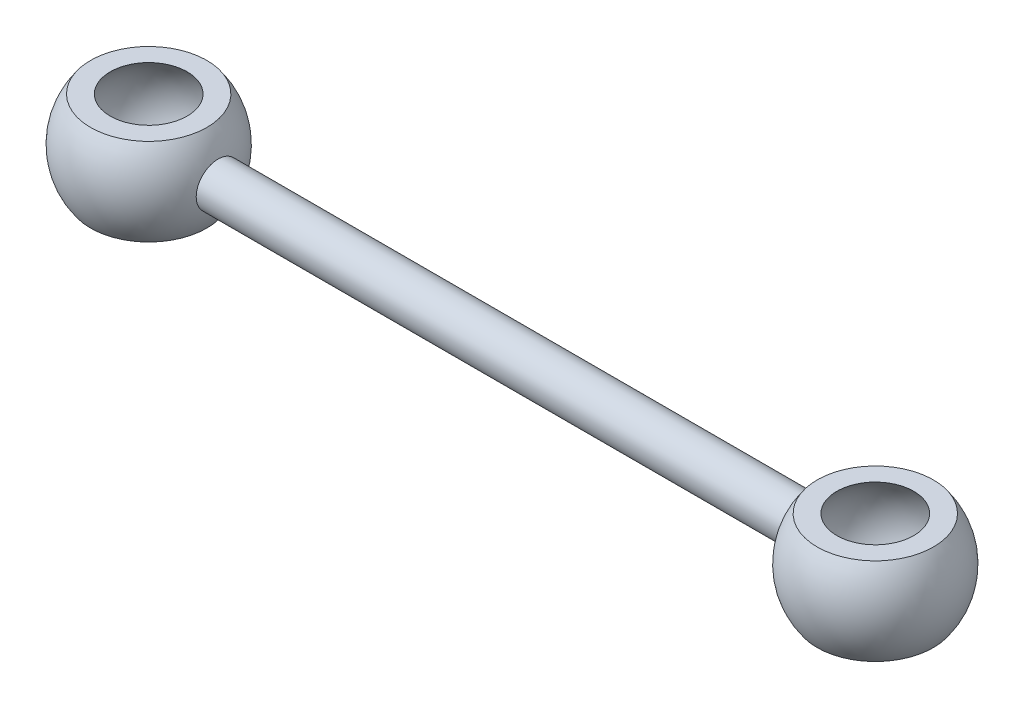
ISO-10303-21;
HEADER;
FILE_DESCRIPTION(('STEP AP214'),'2;1');
FILE_NAME('part.step','',(''),(''),'','','');
FILE_SCHEMA(('AUTOMOTIVE_DESIGN { 1 0 10303 214 1 1 1 1 }'));
ENDSEC;
DATA;
#1=APPLICATION_CONTEXT('core data for automotive mechanical design processes');
#2=APPLICATION_PROTOCOL_DEFINITION('international standard','automotive_design',2000,#1);
#3=PRODUCT_CONTEXT('',#1,'mechanical');
#4=PRODUCT('Part','Part','',(#3));
#5=PRODUCT_RELATED_PRODUCT_CATEGORY('part','',(#4));
#6=PRODUCT_DEFINITION_FORMATION('','',#4);
#7=PRODUCT_DEFINITION_CONTEXT('part definition',#1,'design');
#8=PRODUCT_DEFINITION('design','',#6,#7);
#9=PRODUCT_DEFINITION_SHAPE('','',#8);
#10=(LENGTH_UNIT() NAMED_UNIT(*) SI_UNIT(.MILLI.,.METRE.));
#11=(NAMED_UNIT(*) PLANE_ANGLE_UNIT() SI_UNIT($,.RADIAN.));
#12=(NAMED_UNIT(*) SI_UNIT($,.STERADIAN.) SOLID_ANGLE_UNIT());
#13=UNCERTAINTY_MEASURE_WITH_UNIT(LENGTH_MEASURE(1.E-05),#10,'distance_accuracy_value','');
#14=(GEOMETRIC_REPRESENTATION_CONTEXT(3) GLOBAL_UNCERTAINTY_ASSIGNED_CONTEXT((#13)) GLOBAL_UNIT_ASSIGNED_CONTEXT((#10,
#11,#12)) REPRESENTATION_CONTEXT('',''));
#15=CARTESIAN_POINT('',(0.,0.,0.));
#16=DIRECTION('',(0.,0.,1.));
#17=DIRECTION('',(1.,0.,0.));
#18=AXIS2_PLACEMENT_3D('',#15,#16,#17);
#19=CARTESIAN_POINT('',(25.,0.,0.));
#20=DIRECTION('',(0.,1.,0.));
#21=DIRECTION('',(1.,0.,0.));
#22=AXIS2_PLACEMENT_3D('',#19,#20,#21);
#23=SPHERICAL_SURFACE('',#22,2.5);
#24=CARTESIAN_POINT('',(25.,-1.5,0.));
#25=DIRECTION('',(0.,1.,0.));
#26=DIRECTION('',(0.,0.,1.));
#27=AXIS2_PLACEMENT_3D('',#24,#25,#26);
#28=CIRCLE('',#27,2.);
#29=CARTESIAN_POINT('',(25.,-1.5,2.));
#30=VERTEX_POINT('',#29);
#31=EDGE_CURVE('E65',#30,#30,#28,.T.);
#32=ORIENTED_EDGE('',*,*,#31,.T.);
#33=EDGE_LOOP('',(#32));
#34=FACE_BOUND('',#33,.T.);
#35=CARTESIAN_POINT('',(25.,1.5,0.));
#36=DIRECTION('',(0.,1.,0.));
#37=DIRECTION('',(0.,0.,1.));
#38=AXIS2_PLACEMENT_3D('',#35,#36,#37);
#39=CIRCLE('',#38,2.);
#40=CARTESIAN_POINT('',(25.,1.5,2.));
#41=VERTEX_POINT('',#40);
#42=EDGE_CURVE('E78',#41,#41,#39,.T.);
#43=ORIENTED_EDGE('',*,*,#42,.F.);
#44=EDGE_LOOP('',(#43));
#45=FACE_BOUND('',#44,.T.);
#46=CARTESIAN_POINT('',(22.6151519964576,0.,0.));
#47=DIRECTION('',(0.999999999999999,0.,0.));
#48=DIRECTION('',(0.,0.,-1.));
#49=AXIS2_PLACEMENT_3D('',#46,#47,#48);
#50=CIRCLE('',#49,0.75);
#51=CARTESIAN_POINT('',(22.6151519964576,0.,-0.75));
#52=VERTEX_POINT('',#51);
#53=EDGE_CURVE('E13',#52,#52,#50,.F.);
#54=ORIENTED_EDGE('',*,*,#53,.F.);
#55=EDGE_LOOP('',(#54));
#56=FACE_BOUND('',#55,.T.);
#57=ADVANCED_FACE('F58',(#34,#45,#56),#23,.T.);
#58=CARTESIAN_POINT('',(25.,0.,0.));
#59=DIRECTION('',(0.,1.,0.));
#60=DIRECTION('',(1.,0.,0.));
#61=AXIS2_PLACEMENT_3D('',#58,#59,#60);
#62=SPHERICAL_SURFACE('',#61,2.);
#63=CARTESIAN_POINT('',(25.,-1.5,0.));
#64=DIRECTION('',(0.,1.,0.));
#65=DIRECTION('',(0.,0.,1.));
#66=AXIS2_PLACEMENT_3D('',#63,#64,#65);
#67=CIRCLE('',#66,1.3228756555323);
#68=CARTESIAN_POINT('',(26.3228756555323,-1.5,0.));
#69=VERTEX_POINT('',#68);
#70=EDGE_CURVE('E87',#69,#69,#67,.T.);
#71=CARTESIAN_POINT('',(25.,1.5,0.));
#72=DIRECTION('',(0.,1.,0.));
#73=DIRECTION('',(0.,0.,1.));
#74=AXIS2_PLACEMENT_3D('',#71,#72,#73);
#75=CIRCLE('',#74,1.3228756555323);
#76=CARTESIAN_POINT('',(26.3228756555323,1.5,0.));
#77=VERTEX_POINT('',#76);
#78=EDGE_CURVE('E82',#77,#77,#75,.T.);
#79=CARTESIAN_POINT('',(26.3228756555323,-1.5,0.));
#80=CARTESIAN_POINT('',(26.3493782559357,-1.47662816139122,0.));
#81=CARTESIAN_POINT('',(26.3752601484217,-1.45255263723511,0.));
#82=CARTESIAN_POINT('',(26.425712726278,-1.40306480128789,0.));
#83=CARTESIAN_POINT('',(26.4502834116484,-1.37765248949678,0.));
#84=CARTESIAN_POINT('',(26.4980437839927,-1.32556166173927,0.));
#85=CARTESIAN_POINT('',(26.5212334709667,-1.29888314577287,0.));
#86=CARTESIAN_POINT('',(26.5661669209403,-1.24433505565076,0.));
#87=CARTESIAN_POINT('',(26.58791068394,-1.21646548149505,0.));
#88=CARTESIAN_POINT('',(26.6298911572142,-1.15961349679346,0.));
#89=CARTESIAN_POINT('',(26.6501278674887,-1.13063108624759,0.));
#90=CARTESIAN_POINT('',(26.6890374103518,-1.07163484848067,0.));
#91=CARTESIAN_POINT('',(26.7077102429404,-1.04162102125963,0.));
#92=CARTESIAN_POINT('',(26.7434395790337,-0.980646247498051,0.));
#93=CARTESIAN_POINT('',(26.7604960825384,-0.949685300957505,0.));
#94=CARTESIAN_POINT('',(26.792944854023,-0.88690325132344,0.));
#95=CARTESIAN_POINT('',(26.808337122003,-0.855082148229921,0.));
#96=CARTESIAN_POINT('',(26.8374141890616,-0.79066916283467,0.));
#97=CARTESIAN_POINT('',(26.8510989881403,-0.758077280532937,0.));
#98=CARTESIAN_POINT('',(26.8767226802449,-0.692214279367253,0.));
#99=CARTESIAN_POINT('',(26.8886615732706,-0.658943160503301,0.));
#100=CARTESIAN_POINT('',(26.9107599198396,-0.591815136567553,0.));
#101=CARTESIAN_POINT('',(26.9209193733828,-0.557958231495757,0.));
#102=CARTESIAN_POINT('',(26.9394303055903,-0.48975373085456,0.));
#103=CARTESIAN_POINT('',(26.9477817842546,-0.455406135285158,0.));
#104=CARTESIAN_POINT('',(26.9626533094568,-0.386316727580535,0.));
#105=CARTESIAN_POINT('',(26.9691733559947,-0.351574915445313,0.));
#106=CARTESIAN_POINT('',(26.9803637037403,-0.281794655799961,0.));
#107=CARTESIAN_POINT('',(26.9850340049481,-0.246756208289829,0.));
#108=CARTESIAN_POINT('',(26.9925117443077,-0.176481092260735,0.));
#109=CARTESIAN_POINT('',(26.9953191824597,-0.141244423741773,0.));
#110=CARTESIAN_POINT('',(26.9990633103058,-0.0706718368152065,0.));
#111=CARTESIAN_POINT('',(27.,-0.0353359184076032,0.));
#112=CARTESIAN_POINT('',(27.,0.0353359184076032,0.));
#113=CARTESIAN_POINT('',(26.9990633103058,0.0706718368152065,0.));
#114=CARTESIAN_POINT('',(26.9953191824597,0.141244423741773,0.));
#115=CARTESIAN_POINT('',(26.9925117443077,0.176481092260735,0.));
#116=CARTESIAN_POINT('',(26.9850340049481,0.24675620828983,0.));
#117=CARTESIAN_POINT('',(26.9803637037403,0.281794655799961,0.));
#118=CARTESIAN_POINT('',(26.9691733559947,0.351574915445314,0.));
#119=CARTESIAN_POINT('',(26.9626533094568,0.386316727580535,0.));
#120=CARTESIAN_POINT('',(26.9477817842546,0.455406135285158,0.));
#121=CARTESIAN_POINT('',(26.9394303055903,0.48975373085456,0.));
#122=CARTESIAN_POINT('',(26.9209193733828,0.557958231495757,0.));
#123=CARTESIAN_POINT('',(26.9107599198396,0.591815136567553,0.));
#124=CARTESIAN_POINT('',(26.8886615732706,0.658943160503301,0.));
#125=CARTESIAN_POINT('',(26.8767226802449,0.692214279367253,0.));
#126=CARTESIAN_POINT('',(26.8510989881403,0.758077280532937,0.));
#127=CARTESIAN_POINT('',(26.8374141890616,0.79066916283467,0.));
#128=CARTESIAN_POINT('',(26.808337122003,0.855082148229921,0.));
#129=CARTESIAN_POINT('',(26.792944854023,0.88690325132344,0.));
#130=CARTESIAN_POINT('',(26.7604960825384,0.949685300957505,0.));
#131=CARTESIAN_POINT('',(26.7434395790337,0.980646247498051,0.));
#132=CARTESIAN_POINT('',(26.7077102429404,1.04162102125963,0.));
#133=CARTESIAN_POINT('',(26.6890374103518,1.07163484848067,0.));
#134=CARTESIAN_POINT('',(26.6501278674887,1.13063108624759,0.));
#135=CARTESIAN_POINT('',(26.6298911572142,1.15961349679346,0.));
#136=CARTESIAN_POINT('',(26.58791068394,1.21646548149505,0.));
#137=CARTESIAN_POINT('',(26.5661669209403,1.24433505565076,0.));
#138=CARTESIAN_POINT('',(26.5212334709667,1.29888314577287,0.));
#139=CARTESIAN_POINT('',(26.4980437839927,1.32556166173927,0.));
#140=CARTESIAN_POINT('',(26.4502834116484,1.37765248949678,0.));
#141=CARTESIAN_POINT('',(26.425712726278,1.40306480128789,0.));
#142=CARTESIAN_POINT('',(26.3752601484217,1.45255263723511,0.));
#143=CARTESIAN_POINT('',(26.3493782559357,1.47662816139122,0.));
#144=CARTESIAN_POINT('',(26.3228756555323,1.5,0.));
#145=B_SPLINE_CURVE_WITH_KNOTS('',3,(#79,#80,#81,#82,#83,#84,#85,#86,#87,#88,#89,#90,#91,#92,
#93,#94,#95,#96,#97,#98,#99,#100,#101,#102,#103,#104,#105,#106,#107,#108,#109,#110,#111,#112,
#113,#114,#115,#116,#117,#118,#119,#120,#121,#122,#123,#124,#125,#126,#127,#128,#129,#130,#131,
#132,#133,#134,#135,#136,#137,#138,#139,#140,#141,#142,#143,#144),.UNSPECIFIED.,.F.,.F.,(4,2,2,
2,2,2,2,2,2,2,2,2,2,2,2,2,2,2,2,2,2,2,2,2,2,2,2,2,2,2,2,2,4),(0.,0.105995351166906,
0.211990702333812,0.317986053500718,0.423981404667624,0.52997675583453,0.635972107001436,
0.741967458168343,0.847962809335249,0.953958160502155,1.05995351166906,1.16594886283597,
1.27194421400287,1.37793956516978,1.48393491633669,1.58993026750359,1.6959256186705,
1.8019209698374,1.90791632100431,2.01391167217122,2.11990702333812,2.22590237450503,
2.33189772567194,2.43789307683884,2.54388842800575,2.64988377917265,2.75587913033956,
2.86187448150647,2.96786983267337,3.07386518384028,3.17986053500718,3.28585588617409,
3.391851237341),.UNSPECIFIED.);
#146=EDGE_CURVE('BSEAM98',#69,#77,#145,.T.);
#147=ORIENTED_EDGE('',*,*,#70,.F.);
#148=ORIENTED_EDGE('',*,*,#78,.T.);
#149=ORIENTED_EDGE('',*,*,#146,.T.);
#150=ORIENTED_EDGE('',*,*,#146,.F.);
#151=EDGE_LOOP('',(#147,#149,#148,#150));
#152=FACE_BOUND('',#151,.T.);
#153=ADVANCED_FACE('F98',(#152),#62,.F.);
#154=CARTESIAN_POINT('',(20.8204125088778,-1.5,-2.5));
#155=DIRECTION('',(0.,1.,0.));
#156=DIRECTION('',(0.,0.,1.));
#157=AXIS2_PLACEMENT_3D('',#154,#155,#156);
#158=PLANE('',#157);
#159=ORIENTED_EDGE('',*,*,#70,.T.);
#160=EDGE_LOOP('',(#159));
#161=FACE_BOUND('',#160,.T.);
#162=ORIENTED_EDGE('',*,*,#31,.F.);
#163=EDGE_LOOP('',(#162));
#164=FACE_BOUND('',#163,.T.);
#165=ADVANCED_FACE('F95',(#161,#164),#158,.F.);
#166=CARTESIAN_POINT('',(20.8204125088778,1.5,-2.5));
#167=DIRECTION('',(0.,1.,0.));
#168=DIRECTION('',(0.,0.,1.));
#169=AXIS2_PLACEMENT_3D('',#166,#167,#168);
#170=PLANE('',#169);
#171=ORIENTED_EDGE('',*,*,#78,.F.);
#172=EDGE_LOOP('',(#171));
#173=FACE_BOUND('',#172,.T.);
#174=ORIENTED_EDGE('',*,*,#42,.T.);
#175=EDGE_LOOP('',(#174));
#176=FACE_BOUND('',#175,.T.);
#177=ADVANCED_FACE('F103',(#173,#176),#170,.T.);
#178=CARTESIAN_POINT('',(27.502,0.,0.));
#179=DIRECTION('',(-1.,0.,0.));
#180=DIRECTION('',(0.,0.,1.));
#181=AXIS2_PLACEMENT_3D('',#178,#179,#180);
#182=CYLINDRICAL_SURFACE('',#181,0.75);
#183=ORIENTED_EDGE('',*,*,#53,.T.);
#184=EDGE_LOOP('',(#183));
#185=FACE_BOUND('',#184,.T.);
#186=CARTESIAN_POINT('',(2.38484800354236,0.,0.));
#187=DIRECTION('',(-1.,0.,0.));
#188=DIRECTION('',(0.,0.,1.));
#189=AXIS2_PLACEMENT_3D('',#186,#187,#188);
#190=CIRCLE('',#189,0.75);
#191=CARTESIAN_POINT('',(2.38484800354236,0.,0.75));
#192=VERTEX_POINT('',#191);
#193=EDGE_CURVE('E75',#192,#192,#190,.F.);
#194=ORIENTED_EDGE('',*,*,#193,.T.);
#195=EDGE_LOOP('',(#194));
#196=FACE_BOUND('',#195,.T.);
#197=ADVANCED_FACE('F71',(#185,#196),#182,.T.);
#198=CARTESIAN_POINT('',(0.,0.,0.));
#199=DIRECTION('',(0.,1.,0.));
#200=DIRECTION('',(1.,0.,0.));
#201=AXIS2_PLACEMENT_3D('',#198,#199,#200);
#202=SPHERICAL_SURFACE('',#201,2.5);
#203=CARTESIAN_POINT('',(2.5,0.,0.));
#204=VERTEX_POINT('',#203);
#205=VERTEX_LOOP('',#204);
#206=FACE_BOUND('',#205,.T.);
#207=ORIENTED_EDGE('',*,*,#193,.F.);
#208=EDGE_LOOP('',(#207));
#209=FACE_BOUND('',#208,.T.);
#210=ADVANCED_FACE('F68',(#206,#209),#202,.F.);
#211=CLOSED_SHELL('',(#57,#153,#165,#177,#197,#210));
#212=MANIFOLD_SOLID_BREP('B2',#211);
#213=CARTESIAN_POINT('',(0.,0.,0.));
#214=DIRECTION('',(0.,1.,0.));
#215=DIRECTION('',(1.,0.,0.));
#216=AXIS2_PLACEMENT_3D('',#213,#214,#215);
#217=SPHERICAL_SURFACE('',#216,2.);
#218=CARTESIAN_POINT('',(0.,-1.5,0.));
#219=DIRECTION('',(0.,1.,0.));
#220=DIRECTION('',(0.,0.,1.));
#221=AXIS2_PLACEMENT_3D('',#218,#219,#220);
#222=CIRCLE('',#221,1.3228756555323);
#223=CARTESIAN_POINT('',(1.3228756555323,-1.5,0.));
#224=VERTEX_POINT('',#223);
#225=EDGE_CURVE('E167',#224,#224,#222,.T.);
#226=CARTESIAN_POINT('',(0.,1.5,0.));
#227=DIRECTION('',(0.,1.,0.));
#228=DIRECTION('',(0.,0.,1.));
#229=AXIS2_PLACEMENT_3D('',#226,#227,#228);
#230=CIRCLE('',#229,1.3228756555323);
#231=CARTESIAN_POINT('',(1.3228756555323,1.5,0.));
#232=VERTEX_POINT('',#231);
#233=EDGE_CURVE('E172',#232,#232,#230,.T.);
#234=CARTESIAN_POINT('',(1.3228756555323,-1.5,0.));
#235=CARTESIAN_POINT('',(1.34937825593567,-1.47662816139122,0.));
#236=CARTESIAN_POINT('',(1.37526014842166,-1.45255263723511,0.));
#237=CARTESIAN_POINT('',(1.42571272627802,-1.40306480128789,0.));
#238=CARTESIAN_POINT('',(1.4502834116484,-1.37765248949678,0.));
#239=CARTESIAN_POINT('',(1.49804378399273,-1.32556166173927,0.));
#240=CARTESIAN_POINT('',(1.52123347096668,-1.29888314577287,0.));
#241=CARTESIAN_POINT('',(1.56616692094032,-1.24433505565076,0.));
#242=CARTESIAN_POINT('',(1.58791068394001,-1.21646548149505,0.));
#243=CARTESIAN_POINT('',(1.6298911572142,-1.15961349679346,0.));
#244=CARTESIAN_POINT('',(1.6501278674887,-1.13063108624759,0.));
#245=CARTESIAN_POINT('',(1.68903741035178,-1.07163484848067,0.));
#246=CARTESIAN_POINT('',(1.70771024294036,-1.04162102125963,0.));
#247=CARTESIAN_POINT('',(1.74343957903366,-0.980646247498051,0.));
#248=CARTESIAN_POINT('',(1.76049608253839,-0.949685300957505,0.));
#249=CARTESIAN_POINT('',(1.79294485402304,-0.886903251323441,0.));
#250=CARTESIAN_POINT('',(1.80833712200297,-0.855082148229921,0.));
#251=CARTESIAN_POINT('',(1.83741418906162,-0.790669162834669,0.));
#252=CARTESIAN_POINT('',(1.85109898814035,-0.758077280532937,0.));
#253=CARTESIAN_POINT('',(1.87672268024486,-0.692214279367253,0.));
#254=CARTESIAN_POINT('',(1.88866157327065,-0.658943160503301,0.));
#255=CARTESIAN_POINT('',(1.91075991983964,-0.591815136567553,0.));
#256=CARTESIAN_POINT('',(1.92091937338284,-0.557958231495757,0.));
#257=CARTESIAN_POINT('',(1.9394303055903,-0.48975373085456,0.));
#258=CARTESIAN_POINT('',(1.94778178425457,-0.455406135285158,0.));
#259=CARTESIAN_POINT('',(1.96265330945677,-0.386316727580535,0.));
#260=CARTESIAN_POINT('',(1.9691733559947,-0.351574915445314,0.));
#261=CARTESIAN_POINT('',(1.98036370374035,-0.281794655799961,0.));
#262=CARTESIAN_POINT('',(1.98503400494805,-0.246756208289829,0.));
#263=CARTESIAN_POINT('',(1.99251174430772,-0.176481092260735,0.));
#264=CARTESIAN_POINT('',(1.99531918245968,-0.141244423741773,0.));
#265=CARTESIAN_POINT('',(1.99906331030582,-0.0706718368152065,0.));
#266=CARTESIAN_POINT('',(2.,-0.0353359184076033,0.));
#267=CARTESIAN_POINT('',(2.,0.0353359184076033,0.));
#268=CARTESIAN_POINT('',(1.99906331030582,0.0706718368152065,0.));
#269=CARTESIAN_POINT('',(1.99531918245968,0.141244423741773,0.));
#270=CARTESIAN_POINT('',(1.99251174430772,0.176481092260735,0.));
#271=CARTESIAN_POINT('',(1.98503400494805,0.246756208289829,0.));
#272=CARTESIAN_POINT('',(1.98036370374035,0.281794655799961,0.));
#273=CARTESIAN_POINT('',(1.9691733559947,0.351574915445314,0.));
#274=CARTESIAN_POINT('',(1.96265330945677,0.386316727580535,0.));
#275=CARTESIAN_POINT('',(1.94778178425457,0.455406135285158,0.));
#276=CARTESIAN_POINT('',(1.9394303055903,0.48975373085456,0.));
#277=CARTESIAN_POINT('',(1.92091937338284,0.557958231495757,0.));
#278=CARTESIAN_POINT('',(1.91075991983964,0.591815136567553,0.));
#279=CARTESIAN_POINT('',(1.88866157327065,0.658943160503301,0.));
#280=CARTESIAN_POINT('',(1.87672268024486,0.692214279367253,0.));
#281=CARTESIAN_POINT('',(1.85109898814035,0.758077280532937,0.));
#282=CARTESIAN_POINT('',(1.83741418906162,0.790669162834669,0.));
#283=CARTESIAN_POINT('',(1.80833712200297,0.855082148229921,0.));
#284=CARTESIAN_POINT('',(1.79294485402304,0.886903251323441,0.));
#285=CARTESIAN_POINT('',(1.76049608253839,0.949685300957505,0.));
#286=CARTESIAN_POINT('',(1.74343957903366,0.980646247498051,0.));
#287=CARTESIAN_POINT('',(1.70771024294036,1.04162102125963,0.));
#288=CARTESIAN_POINT('',(1.68903741035178,1.07163484848067,0.));
#289=CARTESIAN_POINT('',(1.6501278674887,1.13063108624759,0.));
#290=CARTESIAN_POINT('',(1.6298911572142,1.15961349679346,0.));
#291=CARTESIAN_POINT('',(1.58791068394001,1.21646548149505,0.));
#292=CARTESIAN_POINT('',(1.56616692094032,1.24433505565076,0.));
#293=CARTESIAN_POINT('',(1.52123347096668,1.29888314577287,0.));
#294=CARTESIAN_POINT('',(1.49804378399273,1.32556166173927,0.));
#295=CARTESIAN_POINT('',(1.4502834116484,1.37765248949678,0.));
#296=CARTESIAN_POINT('',(1.42571272627802,1.40306480128789,0.));
#297=CARTESIAN_POINT('',(1.37526014842166,1.45255263723511,0.));
#298=CARTESIAN_POINT('',(1.34937825593567,1.47662816139122,0.));
#299=CARTESIAN_POINT('',(1.3228756555323,1.5,0.));
#300=B_SPLINE_CURVE_WITH_KNOTS('',3,(#234,#235,#236,#237,#238,#239,#240,#241,#242,#243,#244,
#245,#246,#247,#248,#249,#250,#251,#252,#253,#254,#255,#256,#257,#258,#259,#260,#261,#262,#263,
#264,#265,#266,#267,#268,#269,#270,#271,#272,#273,#274,#275,#276,#277,#278,#279,#280,#281,#282,
#283,#284,#285,#286,#287,#288,#289,#290,#291,#292,#293,#294,#295,#296,#297,#298,#299),
.UNSPECIFIED.,.F.,.F.,(4,2,2,2,2,2,2,2,2,2,2,2,2,2,2,2,2,2,2,2,2,2,2,2,2,2,2,2,2,2,2,2,4),(0.,
0.105995351166906,0.211990702333813,0.317986053500719,0.423981404667625,0.529976755834531,
0.635972107001437,0.741967458168343,0.847962809335249,0.953958160502156,1.05995351166906,
1.16594886283597,1.27194421400287,1.37793956516978,1.48393491633669,1.58993026750359,
1.6959256186705,1.80192096983741,1.90791632100431,2.01391167217122,2.11990702333812,
2.22590237450503,2.33189772567194,2.43789307683884,2.54388842800575,2.64988377917265,
2.75587913033956,2.86187448150647,2.96786983267337,3.07386518384028,3.17986053500718,
3.28585588617409,3.391851237341),.UNSPECIFIED.);
#301=EDGE_CURVE('BSEAM159',#224,#232,#300,.T.);
#302=ORIENTED_EDGE('',*,*,#225,.F.);
#303=ORIENTED_EDGE('',*,*,#233,.T.);
#304=ORIENTED_EDGE('',*,*,#301,.T.);
#305=ORIENTED_EDGE('',*,*,#301,.F.);
#306=EDGE_LOOP('',(#302,#304,#303,#305));
#307=FACE_BOUND('',#306,.T.);
#308=ADVANCED_FACE('F159',(#307),#217,.F.);
#309=CARTESIAN_POINT('',(0.,0.,0.));
#310=DIRECTION('',(0.,1.,0.));
#311=DIRECTION('',(1.,0.,0.));
#312=AXIS2_PLACEMENT_3D('',#309,#310,#311);
#313=SPHERICAL_SURFACE('',#312,2.5);
#314=CARTESIAN_POINT('',(0.,-1.5,0.));
#315=DIRECTION('',(0.,1.,0.));
#316=DIRECTION('',(0.,0.,1.));
#317=AXIS2_PLACEMENT_3D('',#314,#315,#316);
#318=CIRCLE('',#317,2.);
#319=CARTESIAN_POINT('',(2.,-1.5,0.));
#320=VERTEX_POINT('',#319);
#321=EDGE_CURVE('E57',#320,#320,#318,.T.);
#322=CARTESIAN_POINT('',(0.,1.5,0.));
#323=DIRECTION('',(0.,1.,0.));
#324=DIRECTION('',(0.,0.,1.));
#325=AXIS2_PLACEMENT_3D('',#322,#323,#324);
#326=CIRCLE('',#325,2.);
#327=CARTESIAN_POINT('',(2.,1.5,0.));
#328=VERTEX_POINT('',#327);
#329=EDGE_CURVE('E163',#328,#328,#326,.T.);
#330=CARTESIAN_POINT('',(2.,-1.5,0.));
#331=CARTESIAN_POINT('',(2.02010973175637,-1.47318767631209,0.));
#332=CARTESIAN_POINT('',(2.03967964794221,-1.44597052502823,0.));
#333=CARTESIAN_POINT('',(2.07770961374738,-1.3907715618953,0.));
#334=CARTESIAN_POINT('',(2.09616966336672,-1.36278975004623,0.));
#335=CARTESIAN_POINT('',(2.13194966061348,-1.30610646040954,0.));
#336=CARTESIAN_POINT('',(2.1492696082409,-1.27740498262193,0.));
#337=CARTESIAN_POINT('',(2.18274149098161,-1.21932885105217,0.));
#338=CARTESIAN_POINT('',(2.1988934260949,-1.18995419727002,0.));
#339=CARTESIAN_POINT('',(2.23000313347599,-1.1305792036146,0.));
#340=CARTESIAN_POINT('',(2.24496090574381,-1.10057886374133,0.));
#341=CARTESIAN_POINT('',(2.27365810299698,-1.04000102354306,0.));
#342=CARTESIAN_POINT('',(2.28739752798234,-1.00942352321807,0.));
#343=CARTESIAN_POINT('',(2.31363580745685,-0.947740814842814,0.));
#344=CARTESIAN_POINT('',(2.32613466194601,-0.916635606792556,0.));
#345=CARTESIAN_POINT('',(2.34987158611226,-0.853947790881786,0.));
#346=CARTESIAN_POINT('',(2.36110965578936,-0.822365183021274,0.));
#347=CARTESIAN_POINT('',(2.38230683446321,-0.758773647062917,0.));
#348=CARTESIAN_POINT('',(2.39226594345997,-0.726764718965071,0.));
#349=CARTESIAN_POINT('',(2.41088909359125,-0.662372311730419,0.));
#350=CARTESIAN_POINT('',(2.41955313472578,-0.629988832593612,0.));
#351=CARTESIAN_POINT('',(2.43557213646211,-0.5648996982212,0.));
#352=CARTESIAN_POINT('',(2.44292709706391,-0.532194042985595,0.));
#353=CARTESIAN_POINT('',(2.45631604229935,-0.466513452431365,0.));
#354=CARTESIAN_POINT('',(2.462350026933,-0.433538517112739,0.));
#355=CARTESIAN_POINT('',(2.47308726125448,-0.367372697922097,0.));
#356=CARTESIAN_POINT('',(2.47779051094231,-0.33418181405008,0.));
#357=CARTESIAN_POINT('',(2.48585866864015,-0.267637778544155,0.));
#358=CARTESIAN_POINT('',(2.48922357665016,-0.234284626910247,0.));
#359=CARTESIAN_POINT('',(2.49460960880746,-0.167469999113265,0.));
#360=CARTESIAN_POINT('',(2.49663073295476,-0.134008522950191,0.));
#361=CARTESIAN_POINT('',(2.49932592855103,-0.0670313645247449,0.));
#362=CARTESIAN_POINT('',(2.5,-0.0335156822623726,0.));
#363=CARTESIAN_POINT('',(2.5,0.033515682262372,0.));
#364=CARTESIAN_POINT('',(2.49932592855103,0.0670313645247443,0.));
#365=CARTESIAN_POINT('',(2.49663073295476,0.13400852295019,0.));
#366=CARTESIAN_POINT('',(2.49460960880746,0.167469999113264,0.));
#367=CARTESIAN_POINT('',(2.48922357665016,0.234284626910246,0.));
#368=CARTESIAN_POINT('',(2.48585866864015,0.267637778544154,0.));
#369=CARTESIAN_POINT('',(2.47779051094231,0.33418181405008,0.));
#370=CARTESIAN_POINT('',(2.47308726125448,0.367372697922097,0.));
#371=CARTESIAN_POINT('',(2.462350026933,0.433538517112739,0.));
#372=CARTESIAN_POINT('',(2.45631604229935,0.466513452431364,0.));
#373=CARTESIAN_POINT('',(2.44292709706391,0.532194042985594,0.));
#374=CARTESIAN_POINT('',(2.43557213646211,0.564899698221199,0.));
#375=CARTESIAN_POINT('',(2.41955313472578,0.629988832593611,0.));
#376=CARTESIAN_POINT('',(2.41088909359125,0.662372311730418,0.));
#377=CARTESIAN_POINT('',(2.39226594345997,0.726764718965071,0.));
#378=CARTESIAN_POINT('',(2.38230683446321,0.758773647062916,0.));
#379=CARTESIAN_POINT('',(2.36110965578936,0.822365183021273,0.));
#380=CARTESIAN_POINT('',(2.34987158611226,0.853947790881785,0.));
#381=CARTESIAN_POINT('',(2.32613466194601,0.916635606792556,0.));
#382=CARTESIAN_POINT('',(2.31363580745685,0.947740814842814,0.));
#383=CARTESIAN_POINT('',(2.28739752798234,1.00942352321807,0.));
#384=CARTESIAN_POINT('',(2.27365810299698,1.04000102354306,0.));
#385=CARTESIAN_POINT('',(2.24496090574381,1.10057886374133,0.));
#386=CARTESIAN_POINT('',(2.23000313347599,1.1305792036146,0.));
#387=CARTESIAN_POINT('',(2.1988934260949,1.18995419727002,0.));
#388=CARTESIAN_POINT('',(2.18274149098161,1.21932885105217,0.));
#389=CARTESIAN_POINT('',(2.1492696082409,1.27740498262193,0.));
#390=CARTESIAN_POINT('',(2.13194966061348,1.30610646040954,0.));
#391=CARTESIAN_POINT('',(2.09616966336672,1.36278975004623,0.));
#392=CARTESIAN_POINT('',(2.07770961374738,1.3907715618953,0.));
#393=CARTESIAN_POINT('',(2.03967964794221,1.44597052502823,0.));
#394=CARTESIAN_POINT('',(2.02010973175637,1.47318767631208,0.));
#395=CARTESIAN_POINT('',(2.,1.5,0.));
#396=B_SPLINE_CURVE_WITH_KNOTS('',3,(#330,#331,#332,#333,#334,#335,#336,#337,#338,#339,#340,
#341,#342,#343,#344,#345,#346,#347,#348,#349,#350,#351,#352,#353,#354,#355,#356,#357,#358,#359,
#360,#361,#362,#363,#364,#365,#366,#367,#368,#369,#370,#371,#372,#373,#374,#375,#376,#377,#378,
#379,#380,#381,#382,#383,#384,#385,#386,#387,#388,#389,#390,#391,#392,#393,#394,#395),
.UNSPECIFIED.,.F.,.F.,(4,2,2,2,2,2,2,2,2,2,2,2,2,2,2,2,2,2,2,2,2,2,2,2,2,2,2,2,2,2,2,2,4),(0.,
0.100540271710038,0.201080543420077,0.301620815130115,0.402161086840153,0.502701358550192,
0.60324163026023,0.703781901970269,0.804322173680307,0.904862445390345,1.00540271710038,
1.10594298881042,1.20648326052046,1.3070235322305,1.40756380394054,1.50810407565058,
1.60864434736061,1.70918461907065,1.80972489078069,1.91026516249073,2.01080543420077,
2.11134570591081,2.21188597762084,2.31242624933088,2.41296652104092,2.51350679275096,
2.614047064461,2.71458733617104,2.81512760788107,2.91566787959111,3.01620815130115,
3.11674842301119,3.21728869472123),.UNSPECIFIED.);
#397=EDGE_CURVE('BSEAM161',#320,#328,#396,.T.);
#398=ORIENTED_EDGE('',*,*,#321,.T.);
#399=ORIENTED_EDGE('',*,*,#329,.F.);
#400=ORIENTED_EDGE('',*,*,#397,.T.);
#401=ORIENTED_EDGE('',*,*,#397,.F.);
#402=EDGE_LOOP('',(#398,#400,#399,#401));
#403=FACE_BOUND('',#402,.T.);
#404=ADVANCED_FACE('F161',(#403),#313,.T.);
#405=CARTESIAN_POINT('',(-4.17958749112222,-1.5,-2.5));
#406=DIRECTION('',(0.,1.,0.));
#407=DIRECTION('',(0.,0.,1.));
#408=AXIS2_PLACEMENT_3D('',#405,#406,#407);
#409=PLANE('',#408);
#410=ORIENTED_EDGE('',*,*,#225,.T.);
#411=EDGE_LOOP('',(#410));
#412=FACE_BOUND('',#411,.T.);
#413=ORIENTED_EDGE('',*,*,#321,.F.);
#414=EDGE_LOOP('',(#413));
#415=FACE_BOUND('',#414,.T.);
#416=ADVANCED_FACE('F183',(#412,#415),#409,.F.);
#417=CARTESIAN_POINT('',(-4.17958749112222,1.5,-2.5));
#418=DIRECTION('',(0.,1.,0.));
#419=DIRECTION('',(0.,0.,1.));
#420=AXIS2_PLACEMENT_3D('',#417,#418,#419);
#421=PLANE('',#420);
#422=ORIENTED_EDGE('',*,*,#233,.F.);
#423=EDGE_LOOP('',(#422));
#424=FACE_BOUND('',#423,.T.);
#425=ORIENTED_EDGE('',*,*,#329,.T.);
#426=EDGE_LOOP('',(#425));
#427=FACE_BOUND('',#426,.T.);
#428=ADVANCED_FACE('F180',(#424,#427),#421,.T.);
#429=CLOSED_SHELL('',(#308,#404,#416,#428));
#430=MANIFOLD_SOLID_BREP('B7',#429);
#431=ADVANCED_BREP_SHAPE_REPRESENTATION('',(#18,#212,#430),#14);
#432=SHAPE_DEFINITION_REPRESENTATION(#9,#431);
ENDSEC;
END-ISO-10303-21;
